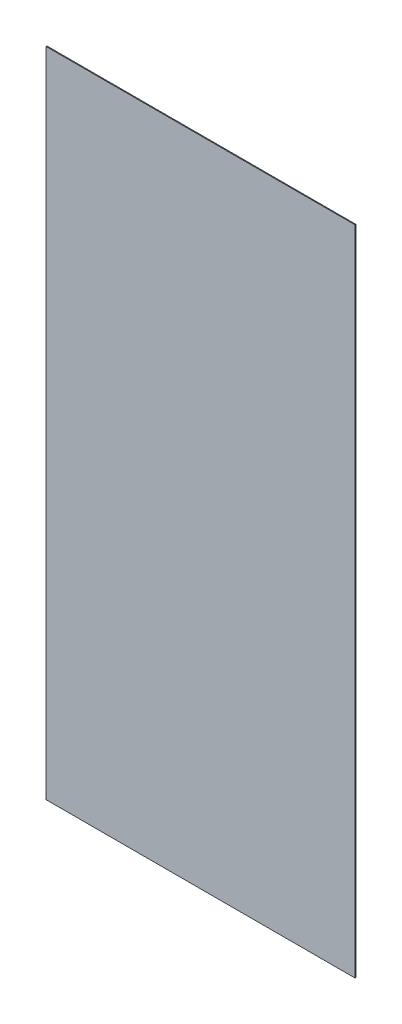
ISO-10303-21;
HEADER;
FILE_DESCRIPTION(('STEP AP214'),'2;1');
FILE_NAME('part.step','',(''),(''),'','','');
FILE_SCHEMA(('AUTOMOTIVE_DESIGN { 1 0 10303 214 1 1 1 1 }'));
ENDSEC;
DATA;
#1=APPLICATION_CONTEXT('core data for automotive mechanical design processes');
#2=APPLICATION_PROTOCOL_DEFINITION('international standard','automotive_design',2000,#1);
#3=PRODUCT_CONTEXT('',#1,'mechanical');
#4=PRODUCT('Part','Part','',(#3));
#5=PRODUCT_RELATED_PRODUCT_CATEGORY('part','',(#4));
#6=PRODUCT_DEFINITION_FORMATION('','',#4);
#7=PRODUCT_DEFINITION_CONTEXT('part definition',#1,'design');
#8=PRODUCT_DEFINITION('design','',#6,#7);
#9=PRODUCT_DEFINITION_SHAPE('','',#8);
#10=(LENGTH_UNIT() NAMED_UNIT(*) SI_UNIT(.MILLI.,.METRE.));
#11=(NAMED_UNIT(*) PLANE_ANGLE_UNIT() SI_UNIT($,.RADIAN.));
#12=(NAMED_UNIT(*) SI_UNIT($,.STERADIAN.) SOLID_ANGLE_UNIT());
#13=UNCERTAINTY_MEASURE_WITH_UNIT(LENGTH_MEASURE(1.E-05),#10,'distance_accuracy_value','');
#14=(GEOMETRIC_REPRESENTATION_CONTEXT(3) GLOBAL_UNCERTAINTY_ASSIGNED_CONTEXT((#13)) GLOBAL_UNIT_ASSIGNED_CONTEXT((#10,
#11,#12)) REPRESENTATION_CONTEXT('',''));
#15=CARTESIAN_POINT('',(0.,0.,0.));
#16=DIRECTION('',(0.,0.,1.));
#17=DIRECTION('',(1.,0.,0.));
#18=AXIS2_PLACEMENT_3D('',#15,#16,#17);
#19=CARTESIAN_POINT('',(-1420.,0.,4.));
#20=DIRECTION('',(1.,0.,0.));
#21=DIRECTION('',(0.,1.,0.));
#22=AXIS2_PLACEMENT_3D('',#19,#20,#21);
#23=PLANE('',#22);
#24=DIRECTION('',(0.,-1.,0.));
#25=VECTOR('',#24,1.);
#26=CARTESIAN_POINT('',(-1420.,0.,0.));
#27=LINE('',#26,#25);
#28=CARTESIAN_POINT('',(-1420.,0.,0.));
#29=VERTEX_POINT('',#28);
#30=CARTESIAN_POINT('',(-1420.,-3000.,0.));
#31=VERTEX_POINT('',#30);
#32=EDGE_CURVE('E107',#29,#31,#27,.T.);
#33=ORIENTED_EDGE('',*,*,#32,.T.);
#34=DIRECTION('',(0.,0.,-1.));
#35=VECTOR('',#34,1.);
#36=CARTESIAN_POINT('',(-1420.,-3000.,4.));
#37=LINE('',#36,#35);
#38=CARTESIAN_POINT('',(-1420.,-3000.,4.));
#39=VERTEX_POINT('',#38);
#40=EDGE_CURVE('E11',#39,#31,#37,.T.);
#41=ORIENTED_EDGE('',*,*,#40,.F.);
#42=DIRECTION('',(0.,-1.,0.));
#43=VECTOR('',#42,1.);
#44=CARTESIAN_POINT('',(-1420.,0.,4.));
#45=LINE('',#44,#43);
#46=CARTESIAN_POINT('',(-1420.,0.,4.));
#47=VERTEX_POINT('',#46);
#48=EDGE_CURVE('E91',#47,#39,#45,.T.);
#49=ORIENTED_EDGE('',*,*,#48,.F.);
#50=DIRECTION('',(0.,0.,-1.));
#51=VECTOR('',#50,1.);
#52=CARTESIAN_POINT('',(-1420.,0.,4.));
#53=LINE('',#52,#51);
#54=EDGE_CURVE('E103',#47,#29,#53,.T.);
#55=ORIENTED_EDGE('',*,*,#54,.T.);
#56=EDGE_LOOP('',(#33,#41,#49,#55));
#57=FACE_BOUND('',#56,.T.);
#58=ADVANCED_FACE('F39',(#57),#23,.F.);
#59=CARTESIAN_POINT('',(-1420.,-3000.,4.));
#60=DIRECTION('',(0.,1.,0.));
#61=DIRECTION('',(-1.,0.,0.));
#62=AXIS2_PLACEMENT_3D('',#59,#60,#61);
#63=PLANE('',#62);
#64=DIRECTION('',(1.,0.,0.));
#65=VECTOR('',#64,1.);
#66=CARTESIAN_POINT('',(-1420.,-3000.,0.));
#67=LINE('',#66,#65);
#68=CARTESIAN_POINT('',(3.60822483003176E-13,-3000.,0.));
#69=VERTEX_POINT('',#68);
#70=EDGE_CURVE('E96',#31,#69,#67,.T.);
#71=ORIENTED_EDGE('',*,*,#70,.T.);
#72=DIRECTION('',(0.,0.,-1.));
#73=VECTOR('',#72,1.);
#74=CARTESIAN_POINT('',(3.60822483003176E-13,-3000.,4.));
#75=LINE('',#74,#73);
#76=CARTESIAN_POINT('',(3.60822483003176E-13,-3000.,4.));
#77=VERTEX_POINT('',#76);
#78=EDGE_CURVE('E48',#77,#69,#75,.T.);
#79=ORIENTED_EDGE('',*,*,#78,.F.);
#80=DIRECTION('',(1.,0.,0.));
#81=VECTOR('',#80,1.);
#82=CARTESIAN_POINT('',(-1420.,-3000.,4.));
#83=LINE('',#82,#81);
#84=EDGE_CURVE('E86',#39,#77,#83,.T.);
#85=ORIENTED_EDGE('',*,*,#84,.F.);
#86=ORIENTED_EDGE('',*,*,#40,.T.);
#87=EDGE_LOOP('',(#71,#79,#85,#86));
#88=FACE_BOUND('',#87,.T.);
#89=ADVANCED_FACE('F95',(#88),#63,.F.);
#90=CARTESIAN_POINT('',(0.,0.,4.));
#91=DIRECTION('',(-1.,0.,0.));
#92=DIRECTION('',(0.,-1.,0.));
#93=AXIS2_PLACEMENT_3D('',#90,#91,#92);
#94=PLANE('',#93);
#95=DIRECTION('',(0.,1.,0.));
#96=VECTOR('',#95,1.);
#97=CARTESIAN_POINT('',(0.,0.,0.));
#98=LINE('',#97,#96);
#99=CARTESIAN_POINT('',(0.,0.,0.));
#100=VERTEX_POINT('',#99);
#101=EDGE_CURVE('E73',#69,#100,#98,.T.);
#102=ORIENTED_EDGE('',*,*,#101,.T.);
#103=DIRECTION('',(0.,0.,-1.));
#104=VECTOR('',#103,1.);
#105=CARTESIAN_POINT('',(0.,0.,4.));
#106=LINE('',#105,#104);
#107=CARTESIAN_POINT('',(0.,0.,4.));
#108=VERTEX_POINT('',#107);
#109=EDGE_CURVE('E98',#108,#100,#106,.T.);
#110=ORIENTED_EDGE('',*,*,#109,.F.);
#111=DIRECTION('',(0.,1.,0.));
#112=VECTOR('',#111,1.);
#113=CARTESIAN_POINT('',(0.,0.,4.));
#114=LINE('',#113,#112);
#115=EDGE_CURVE('E89',#77,#108,#114,.T.);
#116=ORIENTED_EDGE('',*,*,#115,.F.);
#117=ORIENTED_EDGE('',*,*,#78,.T.);
#118=EDGE_LOOP('',(#102,#110,#116,#117));
#119=FACE_BOUND('',#118,.T.);
#120=ADVANCED_FACE('F99',(#119),#94,.F.);
#121=CARTESIAN_POINT('',(-1420.,0.,4.));
#122=DIRECTION('',(0.,-1.,0.));
#123=DIRECTION('',(0.,0.,-1.));
#124=AXIS2_PLACEMENT_3D('',#121,#122,#123);
#125=PLANE('',#124);
#126=DIRECTION('',(-1.,0.,0.));
#127=VECTOR('',#126,1.);
#128=CARTESIAN_POINT('',(-1420.,0.,0.));
#129=LINE('',#128,#127);
#130=EDGE_CURVE('E79',#100,#29,#129,.T.);
#131=ORIENTED_EDGE('',*,*,#130,.T.);
#132=ORIENTED_EDGE('',*,*,#54,.F.);
#133=DIRECTION('',(-1.,0.,0.));
#134=VECTOR('',#133,1.);
#135=CARTESIAN_POINT('',(-1420.,0.,4.));
#136=LINE('',#135,#134);
#137=EDGE_CURVE('E56',#108,#47,#136,.T.);
#138=ORIENTED_EDGE('',*,*,#137,.F.);
#139=ORIENTED_EDGE('',*,*,#109,.T.);
#140=EDGE_LOOP('',(#131,#132,#138,#139));
#141=FACE_BOUND('',#140,.T.);
#142=ADVANCED_FACE('F120',(#141),#125,.F.);
#143=CARTESIAN_POINT('',(0.,0.,4.));
#144=DIRECTION('',(0.,0.,1.));
#145=DIRECTION('',(1.,0.,0.));
#146=AXIS2_PLACEMENT_3D('',#143,#144,#145);
#147=PLANE('',#146);
#148=ORIENTED_EDGE('',*,*,#48,.T.);
#149=ORIENTED_EDGE('',*,*,#84,.T.);
#150=ORIENTED_EDGE('',*,*,#115,.T.);
#151=ORIENTED_EDGE('',*,*,#137,.T.);
#152=EDGE_LOOP('',(#148,#149,#150,#151));
#153=FACE_BOUND('',#152,.T.);
#154=ADVANCED_FACE('F87',(#153),#147,.T.);
#155=CARTESIAN_POINT('',(0.,0.,0.));
#156=DIRECTION('',(0.,0.,1.));
#157=DIRECTION('',(1.,0.,0.));
#158=AXIS2_PLACEMENT_3D('',#155,#156,#157);
#159=PLANE('',#158);
#160=ORIENTED_EDGE('',*,*,#32,.F.);
#161=ORIENTED_EDGE('',*,*,#130,.F.);
#162=ORIENTED_EDGE('',*,*,#101,.F.);
#163=ORIENTED_EDGE('',*,*,#70,.F.);
#164=EDGE_LOOP('',(#160,#161,#162,#163));
#165=FACE_BOUND('',#164,.T.);
#166=ADVANCED_FACE('F123',(#165),#159,.F.);
#167=CLOSED_SHELL('',(#58,#89,#120,#142,#154,#166));
#168=MANIFOLD_SOLID_BREP('B2',#167);
#169=ADVANCED_BREP_SHAPE_REPRESENTATION('',(#18,#168),#14);
#170=SHAPE_DEFINITION_REPRESENTATION(#9,#169);
ENDSEC;
END-ISO-10303-21;
